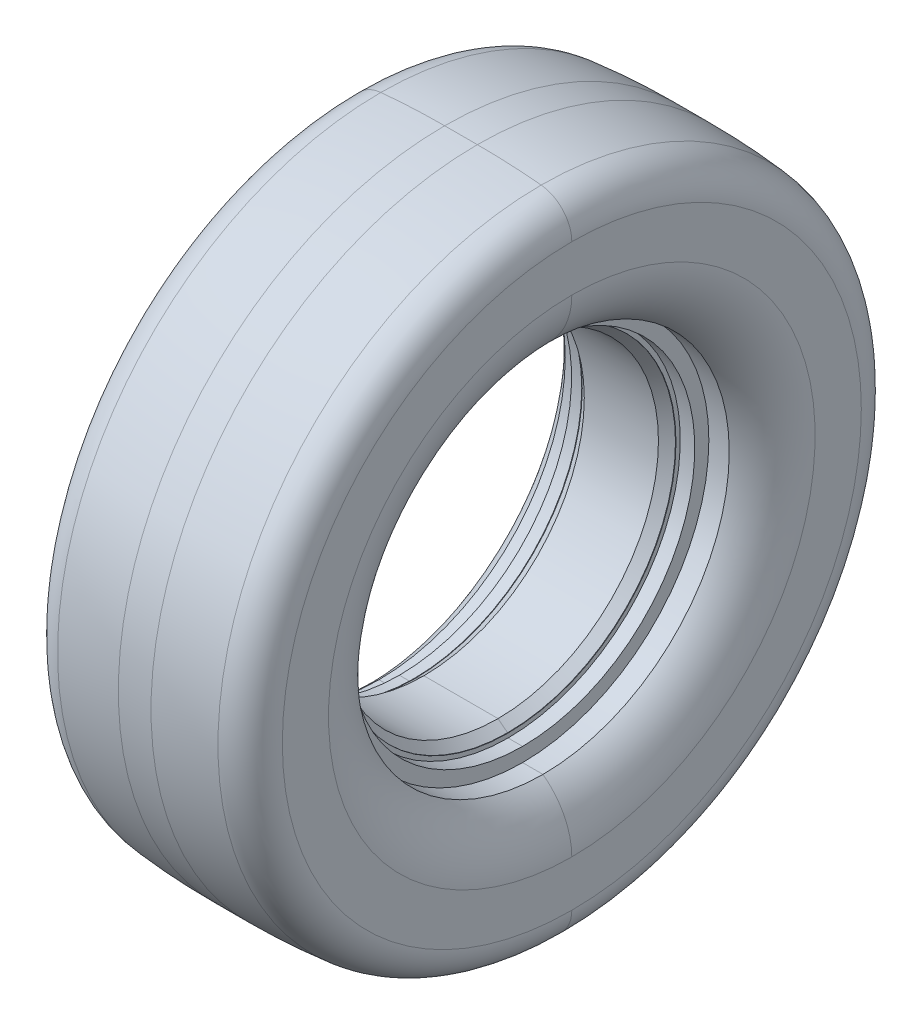
ISO-10303-21;
HEADER;
FILE_DESCRIPTION(('STEP AP214'),'2;1');
FILE_NAME('part.step','',(''),(''),'','','');
FILE_SCHEMA(('AUTOMOTIVE_DESIGN { 1 0 10303 214 1 1 1 1 }'));
ENDSEC;
DATA;
#1=APPLICATION_CONTEXT('core data for automotive mechanical design processes');
#2=APPLICATION_PROTOCOL_DEFINITION('international standard','automotive_design',2000,#1);
#3=PRODUCT_CONTEXT('',#1,'mechanical');
#4=PRODUCT('Part','Part','',(#3));
#5=PRODUCT_RELATED_PRODUCT_CATEGORY('part','',(#4));
#6=PRODUCT_DEFINITION_FORMATION('','',#4);
#7=PRODUCT_DEFINITION_CONTEXT('part definition',#1,'design');
#8=PRODUCT_DEFINITION('design','',#6,#7);
#9=PRODUCT_DEFINITION_SHAPE('','',#8);
#10=(LENGTH_UNIT() NAMED_UNIT(*) SI_UNIT(.MILLI.,.METRE.));
#11=(NAMED_UNIT(*) PLANE_ANGLE_UNIT() SI_UNIT($,.RADIAN.));
#12=(NAMED_UNIT(*) SI_UNIT($,.STERADIAN.) SOLID_ANGLE_UNIT());
#13=UNCERTAINTY_MEASURE_WITH_UNIT(LENGTH_MEASURE(1.E-05),#10,'distance_accuracy_value','');
#14=(GEOMETRIC_REPRESENTATION_CONTEXT(3) GLOBAL_UNCERTAINTY_ASSIGNED_CONTEXT((#13)) GLOBAL_UNIT_ASSIGNED_CONTEXT((#10,
#11,#12)) REPRESENTATION_CONTEXT('',''));
#15=CARTESIAN_POINT('',(0.,0.,0.));
#16=DIRECTION('',(0.,0.,1.));
#17=DIRECTION('',(1.,0.,0.));
#18=AXIS2_PLACEMENT_3D('',#15,#16,#17);
#19=CARTESIAN_POINT('',(-55.0616473772124,-7.13441573293494,32.9182579355347));
#20=DIRECTION('',(-1.,0.,0.));
#21=DIRECTION('',(0.,-1.,0.));
#22=AXIS2_PLACEMENT_3D('',#19,#20,#21);
#23=CYLINDRICAL_SURFACE('',#22,24.1681);
#24=DIRECTION('',(-1.,0.,0.));
#25=VECTOR('',#24,1.);
#26=CARTESIAN_POINT('',(-55.0616473772124,17.0336842670651,32.9182579355347));
#27=LINE('',#26,#25);
#28=CARTESIAN_POINT('',(-56.5729473772124,17.0336842670651,32.9182579355347));
#29=VERTEX_POINT('',#28);
#30=CARTESIAN_POINT('',(-67.7489473772124,17.0336842670651,32.9182579355347));
#31=VERTEX_POINT('',#30);
#32=EDGE_CURVE('E234',#29,#31,#27,.T.);
#33=ORIENTED_EDGE('',*,*,#32,.F.);
#34=CARTESIAN_POINT('',(-56.5729473772124,-7.13441573293494,32.9182579355347));
#35=DIRECTION('',(-1.,0.,0.));
#36=DIRECTION('',(0.,-1.,0.));
#37=AXIS2_PLACEMENT_3D('',#34,#35,#36);
#38=CIRCLE('',#37,24.1681);
#39=CARTESIAN_POINT('',(-56.5729473772124,-31.302515732935,32.9182579355347));
#40=VERTEX_POINT('',#39);
#41=EDGE_CURVE('E249',#40,#29,#38,.T.);
#42=ORIENTED_EDGE('',*,*,#41,.F.);
#43=DIRECTION('',(-1.,0.,0.));
#44=VECTOR('',#43,1.);
#45=CARTESIAN_POINT('',(-55.0616473772124,-31.302515732935,32.9182579355347));
#46=LINE('',#45,#44);
#47=CARTESIAN_POINT('',(-67.7489473772124,-31.3025157329349,32.9182579355347));
#48=VERTEX_POINT('',#47);
#49=EDGE_CURVE('E233',#40,#48,#46,.T.);
#50=ORIENTED_EDGE('',*,*,#49,.T.);
#51=CARTESIAN_POINT('',(-67.7489473772124,-7.13441573293493,32.9182579355347));
#52=DIRECTION('',(-1.,0.,0.));
#53=DIRECTION('',(0.,-1.,0.));
#54=AXIS2_PLACEMENT_3D('',#51,#52,#53);
#55=CIRCLE('',#54,24.1681);
#56=EDGE_CURVE('E11',#48,#31,#55,.T.);
#57=ORIENTED_EDGE('',*,*,#56,.T.);
#58=EDGE_LOOP('',(#33,#42,#50,#57));
#59=FACE_BOUND('',#58,.T.);
#60=ADVANCED_FACE('F17',(#59),#23,.F.);
#61=CARTESIAN_POINT('',(-67.7489473772124,-7.13441573293493,32.9182579355347));
#62=DIRECTION('',(-1.,0.,0.));
#63=DIRECTION('',(0.,-1.,0.));
#64=AXIS2_PLACEMENT_3D('',#61,#62,#63);
#65=CONICAL_SURFACE('',#64,24.1681,0.667140654258367);
#66=DIRECTION('',(-0.785594072893806,0.618742234403084,0.));
#67=VECTOR('',#66,1.);
#68=CARTESIAN_POINT('',(-67.7489473772124,17.0336842670651,32.9182579355347));
#69=LINE('',#68,#67);
#70=CARTESIAN_POINT('',(-69.1840473772124,18.163984267065,32.9182579355347));
#71=VERTEX_POINT('',#70);
#72=EDGE_CURVE('E223',#31,#71,#69,.T.);
#73=ORIENTED_EDGE('',*,*,#72,.F.);
#74=ORIENTED_EDGE('',*,*,#56,.F.);
#75=DIRECTION('',(-0.785594072893807,-0.618742234403083,0.));
#76=VECTOR('',#75,1.);
#77=CARTESIAN_POINT('',(-67.7489473772124,-31.3025157329349,32.9182579355347));
#78=LINE('',#77,#76);
#79=CARTESIAN_POINT('',(-69.1840473772124,-32.4328157329349,32.9182579355347));
#80=VERTEX_POINT('',#79);
#81=EDGE_CURVE('E299',#48,#80,#78,.T.);
#82=ORIENTED_EDGE('',*,*,#81,.T.);
#83=CARTESIAN_POINT('',(-69.1840473772124,-7.13441573293493,32.9182579355347));
#84=DIRECTION('',(-1.,0.,0.));
#85=DIRECTION('',(0.,-1.,0.));
#86=AXIS2_PLACEMENT_3D('',#83,#84,#85);
#87=CIRCLE('',#86,25.2984);
#88=EDGE_CURVE('E27',#80,#71,#87,.T.);
#89=ORIENTED_EDGE('',*,*,#88,.T.);
#90=EDGE_LOOP('',(#73,#74,#82,#89));
#91=FACE_BOUND('',#90,.T.);
#92=ADVANCED_FACE('F640',(#91),#65,.F.);
#93=CARTESIAN_POINT('',(-55.0616473772124,-7.13441573293494,32.9182579355347));
#94=DIRECTION('',(-1.,0.,0.));
#95=DIRECTION('',(0.,-1.,0.));
#96=AXIS2_PLACEMENT_3D('',#93,#94,#95);
#97=CYLINDRICAL_SURFACE('',#96,25.2984);
#98=DIRECTION('',(-1.,0.,0.));
#99=VECTOR('',#98,1.);
#100=CARTESIAN_POINT('',(-55.0616473772124,18.163984267065,32.9182579355347));
#101=LINE('',#100,#99);
#102=CARTESIAN_POINT('',(-69.2602473772124,18.163984267065,32.9182579355347));
#103=VERTEX_POINT('',#102);
#104=EDGE_CURVE('E294',#71,#103,#101,.T.);
#105=ORIENTED_EDGE('',*,*,#104,.F.);
#106=ORIENTED_EDGE('',*,*,#88,.F.);
#107=DIRECTION('',(-1.,0.,0.));
#108=VECTOR('',#107,1.);
#109=CARTESIAN_POINT('',(-55.0616473772124,-32.432815732935,32.9182579355347));
#110=LINE('',#109,#108);
#111=CARTESIAN_POINT('',(-69.2602473772124,-32.4328157329349,32.9182579355347));
#112=VERTEX_POINT('',#111);
#113=EDGE_CURVE('E318',#80,#112,#110,.T.);
#114=ORIENTED_EDGE('',*,*,#113,.T.);
#115=CARTESIAN_POINT('',(-69.2602473772124,-7.13441573293493,32.9182579355347));
#116=DIRECTION('',(-1.,0.,0.));
#117=DIRECTION('',(0.,-1.,0.));
#118=AXIS2_PLACEMENT_3D('',#115,#116,#117);
#119=CIRCLE('',#118,25.2984);
#120=EDGE_CURVE('E253',#112,#103,#119,.T.);
#121=ORIENTED_EDGE('',*,*,#120,.T.);
#122=EDGE_LOOP('',(#105,#106,#114,#121));
#123=FACE_BOUND('',#122,.T.);
#124=ADVANCED_FACE('F538',(#123),#97,.F.);
#125=CARTESIAN_POINT('',(-55.0616473772124,-7.13441573293494,32.9182579355347));
#126=DIRECTION('',(-1.,0.,0.));
#127=DIRECTION('',(0.,-1.,0.));
#128=AXIS2_PLACEMENT_3D('',#125,#126,#127);
#129=CYLINDRICAL_SURFACE('',#128,25.2984);
#130=DIRECTION('',(-1.,0.,0.));
#131=VECTOR('',#130,1.);
#132=CARTESIAN_POINT('',(-55.0616473772124,18.163984267065,32.9182579355347));
#133=LINE('',#132,#131);
#134=CARTESIAN_POINT('',(-55.0616473772124,18.163984267065,32.9182579355347));
#135=VERTEX_POINT('',#134);
#136=CARTESIAN_POINT('',(-55.1378473772123,18.163984267065,32.9182579355347));
#137=VERTEX_POINT('',#136);
#138=EDGE_CURVE('E304',#135,#137,#133,.T.);
#139=ORIENTED_EDGE('',*,*,#138,.F.);
#140=CARTESIAN_POINT('',(-55.0616473772124,-7.13441573293494,32.9182579355347));
#141=DIRECTION('',(-1.,0.,0.));
#142=DIRECTION('',(0.,-1.,0.));
#143=AXIS2_PLACEMENT_3D('',#140,#141,#142);
#144=CIRCLE('',#143,25.2984);
#145=CARTESIAN_POINT('',(-55.0616473772124,-32.432815732935,32.9182579355347));
#146=VERTEX_POINT('',#145);
#147=EDGE_CURVE('E354',#146,#135,#144,.T.);
#148=ORIENTED_EDGE('',*,*,#147,.F.);
#149=DIRECTION('',(-1.,0.,0.));
#150=VECTOR('',#149,1.);
#151=CARTESIAN_POINT('',(-55.0616473772124,-32.432815732935,32.9182579355347));
#152=LINE('',#151,#150);
#153=CARTESIAN_POINT('',(-55.1378473772124,-32.432815732935,32.9182579355347));
#154=VERTEX_POINT('',#153);
#155=EDGE_CURVE('E348',#146,#154,#152,.T.);
#156=ORIENTED_EDGE('',*,*,#155,.T.);
#157=CARTESIAN_POINT('',(-55.1378473772124,-7.13441573293494,32.9182579355347));
#158=DIRECTION('',(-1.,0.,0.));
#159=DIRECTION('',(0.,-1.,0.));
#160=AXIS2_PLACEMENT_3D('',#157,#158,#159);
#161=CIRCLE('',#160,25.2984);
#162=EDGE_CURVE('E246',#154,#137,#161,.T.);
#163=ORIENTED_EDGE('',*,*,#162,.T.);
#164=EDGE_LOOP('',(#139,#148,#156,#163));
#165=FACE_BOUND('',#164,.T.);
#166=ADVANCED_FACE('F452',(#165),#129,.F.);
#167=CARTESIAN_POINT('',(-56.5729473772124,-7.13441573293494,32.9182579355347));
#168=DIRECTION('',(1.,0.,0.));
#169=DIRECTION('',(0.,1.,0.));
#170=AXIS2_PLACEMENT_3D('',#167,#168,#169);
#171=CONICAL_SURFACE('',#170,24.1681,0.667140654258367);
#172=DIRECTION('',(0.785594072893806,-0.618742234403084,0.));
#173=VECTOR('',#172,1.);
#174=CARTESIAN_POINT('',(-56.5729473772124,-31.302515732935,32.9182579355347));
#175=LINE('',#174,#173);
#176=EDGE_CURVE('E347',#40,#154,#175,.T.);
#177=ORIENTED_EDGE('',*,*,#176,.F.);
#178=ORIENTED_EDGE('',*,*,#41,.T.);
#179=DIRECTION('',(0.785594072893807,0.618742234403084,0.));
#180=VECTOR('',#179,1.);
#181=CARTESIAN_POINT('',(-56.5729473772124,17.0336842670651,32.9182579355347));
#182=LINE('',#181,#180);
#183=EDGE_CURVE('E343',#29,#137,#182,.T.);
#184=ORIENTED_EDGE('',*,*,#183,.T.);
#185=ORIENTED_EDGE('',*,*,#162,.F.);
#186=EDGE_LOOP('',(#177,#178,#184,#185));
#187=FACE_BOUND('',#186,.T.);
#188=ADVANCED_FACE('F435',(#187),#171,.F.);
#189=CARTESIAN_POINT('',(-69.2602473772124,0.,32.9182579355347));
#190=DIRECTION('',(-1.,0.,0.));
#191=DIRECTION('',(0.,0.,1.));
#192=AXIS2_PLACEMENT_3D('',#189,#190,#191);
#193=PLANE('',#192);
#194=ORIENTED_EDGE('',*,*,#120,.F.);
#195=CARTESIAN_POINT('',(-69.2602473772124,-7.13441573293493,32.9182579355347));
#196=DIRECTION('',(-1.,0.,0.));
#197=DIRECTION('',(0.,-1.,0.));
#198=AXIS2_PLACEMENT_3D('',#195,#196,#197);
#199=CIRCLE('',#198,25.2984);
#200=EDGE_CURVE('E298',#103,#112,#199,.T.);
#201=ORIENTED_EDGE('',*,*,#200,.F.);
#202=EDGE_LOOP('',(#194,#201));
#203=FACE_BOUND('',#202,.T.);
#204=CARTESIAN_POINT('',(-69.2602473772124,-7.13441573293493,32.9182579355347));
#205=DIRECTION('',(-1.,0.,0.));
#206=DIRECTION('',(0.,-1.,0.));
#207=AXIS2_PLACEMENT_3D('',#204,#205,#206);
#208=CIRCLE('',#207,25.9461);
#209=CARTESIAN_POINT('',(-69.2602473772124,-33.0805157329349,32.9182579355347));
#210=VERTEX_POINT('',#209);
#211=CARTESIAN_POINT('',(-69.2602473772124,18.8116842670651,32.9182579355347));
#212=VERTEX_POINT('',#211);
#213=EDGE_CURVE('E199',#210,#212,#208,.T.);
#214=ORIENTED_EDGE('',*,*,#213,.T.);
#215=CARTESIAN_POINT('',(-69.2602473772124,-7.13441573293493,32.9182579355347));
#216=DIRECTION('',(-1.,0.,0.));
#217=DIRECTION('',(0.,-1.,0.));
#218=AXIS2_PLACEMENT_3D('',#215,#216,#217);
#219=CIRCLE('',#218,25.9461);
#220=EDGE_CURVE('E219',#212,#210,#219,.T.);
#221=ORIENTED_EDGE('',*,*,#220,.T.);
#222=EDGE_LOOP('',(#214,#221));
#223=FACE_BOUND('',#222,.T.);
#224=ADVANCED_FACE('F585',(#203,#223),#193,.T.);
#225=CARTESIAN_POINT('',(-55.0616473772124,-7.13441573293494,32.9182579355347));
#226=DIRECTION('',(-1.,0.,0.));
#227=DIRECTION('',(0.,-1.,0.));
#228=AXIS2_PLACEMENT_3D('',#225,#226,#227);
#229=CYLINDRICAL_SURFACE('',#228,25.9461);
#230=DIRECTION('',(-1.,0.,0.));
#231=VECTOR('',#230,1.);
#232=CARTESIAN_POINT('',(-55.0616473772124,18.8116842670651,32.9182579355347));
#233=LINE('',#232,#231);
#234=CARTESIAN_POINT('',(-71.4446473772124,18.8116842670651,32.9182579355347));
#235=VERTEX_POINT('',#234);
#236=EDGE_CURVE('E211',#212,#235,#233,.T.);
#237=ORIENTED_EDGE('',*,*,#236,.F.);
#238=ORIENTED_EDGE('',*,*,#213,.F.);
#239=DIRECTION('',(-1.,0.,0.));
#240=VECTOR('',#239,1.);
#241=CARTESIAN_POINT('',(-55.0616473772124,-33.0805157329349,32.9182579355347));
#242=LINE('',#241,#240);
#243=CARTESIAN_POINT('',(-71.4446473772124,-33.0805157329349,32.9182579355347));
#244=VERTEX_POINT('',#243);
#245=EDGE_CURVE('E202',#210,#244,#242,.T.);
#246=ORIENTED_EDGE('',*,*,#245,.T.);
#247=CARTESIAN_POINT('',(-71.4446473772124,-7.13441573293493,32.9182579355347));
#248=DIRECTION('',(-1.,0.,0.));
#249=DIRECTION('',(0.,-1.,0.));
#250=AXIS2_PLACEMENT_3D('',#247,#248,#249);
#251=CIRCLE('',#250,25.9461);
#252=EDGE_CURVE('E189',#244,#235,#251,.T.);
#253=ORIENTED_EDGE('',*,*,#252,.T.);
#254=EDGE_LOOP('',(#237,#238,#246,#253));
#255=FACE_BOUND('',#254,.T.);
#256=ADVANCED_FACE('F203',(#255),#229,.F.);
#257=CARTESIAN_POINT('',(-71.4446473772124,0.,32.9182579355347));
#258=DIRECTION('',(-1.,0.,0.));
#259=DIRECTION('',(0.,0.,1.));
#260=AXIS2_PLACEMENT_3D('',#257,#258,#259);
#261=PLANE('',#260);
#262=ORIENTED_EDGE('',*,*,#252,.F.);
#263=CARTESIAN_POINT('',(-71.4446473772124,-7.13441573293493,32.9182579355347));
#264=DIRECTION('',(-1.,0.,0.));
#265=DIRECTION('',(0.,-1.,0.));
#266=AXIS2_PLACEMENT_3D('',#263,#264,#265);
#267=CIRCLE('',#266,25.9461);
#268=EDGE_CURVE('E194',#235,#244,#267,.T.);
#269=ORIENTED_EDGE('',*,*,#268,.F.);
#270=EDGE_LOOP('',(#262,#269));
#271=FACE_BOUND('',#270,.T.);
#272=CARTESIAN_POINT('',(-71.4446473772124,-7.13441573293493,32.9182579355347));
#273=DIRECTION('',(-1.,0.,0.));
#274=DIRECTION('',(0.,-1.,0.));
#275=AXIS2_PLACEMENT_3D('',#272,#273,#274);
#276=CIRCLE('',#275,28.067);
#277=CARTESIAN_POINT('',(-71.4446473772124,-35.2014157329349,32.9182579355347));
#278=VERTEX_POINT('',#277);
#279=CARTESIAN_POINT('',(-71.4446473772124,20.932584267065,32.9182579355347));
#280=VERTEX_POINT('',#279);
#281=EDGE_CURVE('E178',#278,#280,#276,.T.);
#282=ORIENTED_EDGE('',*,*,#281,.T.);
#283=CARTESIAN_POINT('',(-71.4446473772124,-7.13441573293493,32.9182579355347));
#284=DIRECTION('',(-1.,0.,0.));
#285=DIRECTION('',(0.,-1.,0.));
#286=AXIS2_PLACEMENT_3D('',#283,#284,#285);
#287=CIRCLE('',#286,28.067);
#288=EDGE_CURVE('E208',#280,#278,#287,.T.);
#289=ORIENTED_EDGE('',*,*,#288,.T.);
#290=EDGE_LOOP('',(#282,#289));
#291=FACE_BOUND('',#290,.T.);
#292=ADVANCED_FACE('F191',(#271,#291),#261,.T.);
#293=CARTESIAN_POINT('',(-55.0616473772124,-7.13441573293494,32.9182579355347));
#294=DIRECTION('',(-1.,0.,0.));
#295=DIRECTION('',(0.,-1.,0.));
#296=AXIS2_PLACEMENT_3D('',#293,#294,#295);
#297=CYLINDRICAL_SURFACE('',#296,28.067);
#298=DIRECTION('',(-1.,0.,0.));
#299=VECTOR('',#298,1.);
#300=CARTESIAN_POINT('',(-55.0616473772124,20.932584267065,32.9182579355347));
#301=LINE('',#300,#299);
#302=CARTESIAN_POINT('',(-74.5171951928295,20.932584267065,32.9182579355347));
#303=VERTEX_POINT('',#302);
#304=EDGE_CURVE('E303',#280,#303,#301,.T.);
#305=ORIENTED_EDGE('',*,*,#304,.F.);
#306=ORIENTED_EDGE('',*,*,#281,.F.);
#307=DIRECTION('',(-1.,0.,0.));
#308=VECTOR('',#307,1.);
#309=CARTESIAN_POINT('',(-55.0616473772124,-35.2014157329349,32.9182579355347));
#310=LINE('',#309,#308);
#311=CARTESIAN_POINT('',(-74.5171951928295,-35.2014157329349,32.9182579355347));
#312=VERTEX_POINT('',#311);
#313=EDGE_CURVE('E225',#278,#312,#310,.T.);
#314=ORIENTED_EDGE('',*,*,#313,.T.);
#315=CARTESIAN_POINT('',(-74.5171951928295,-7.13441573293493,32.9182579355347));
#316=DIRECTION('',(-1.,0.,0.));
#317=DIRECTION('',(0.,-1.,0.));
#318=AXIS2_PLACEMENT_3D('',#315,#316,#317);
#319=CIRCLE('',#318,28.067);
#320=EDGE_CURVE('E167',#312,#303,#319,.T.);
#321=ORIENTED_EDGE('',*,*,#320,.T.);
#322=EDGE_LOOP('',(#305,#306,#314,#321));
#323=FACE_BOUND('',#322,.T.);
#324=ADVANCED_FACE('F19',(#323),#297,.F.);
#325=CARTESIAN_POINT('',(-68.181080824701,-7.13441573293493,32.9182579355347));
#326=DIRECTION('',(-1.,0.,0.));
#327=DIRECTION('',(0.,-1.,0.));
#328=AXIS2_PLACEMENT_3D('',#325,#326,#327);
#329=TOROIDAL_SURFACE('',#328,36.6649,10.6803665525114);
#330=CARTESIAN_POINT('',(-68.1810808247009,29.530484267065,32.9182579355347));
#331=DIRECTION('',(0.,0.,1.));
#332=DIRECTION('',(0.,-1.,0.));
#333=AXIS2_PLACEMENT_3D('',#330,#331,#332);
#334=CIRCLE('',#333,10.6803665525114);
#335=CARTESIAN_POINT('',(-78.8614473772124,29.530484267065,32.9182579355347));
#336=VERTEX_POINT('',#335);
#337=EDGE_CURVE('E257',#336,#303,#334,.T.);
#338=ORIENTED_EDGE('',*,*,#337,.F.);
#339=CARTESIAN_POINT('',(-78.8614473772124,-7.13441573293492,32.9182579355347));
#340=DIRECTION('',(-1.,0.,0.));
#341=DIRECTION('',(0.,-1.,0.));
#342=AXIS2_PLACEMENT_3D('',#339,#340,#341);
#343=CIRCLE('',#342,36.6649);
#344=CARTESIAN_POINT('',(-78.8614473772124,-43.7993157329349,32.9182579355347));
#345=VERTEX_POINT('',#344);
#346=EDGE_CURVE('E369',#336,#345,#343,.T.);
#347=ORIENTED_EDGE('',*,*,#346,.T.);
#348=CARTESIAN_POINT('',(-68.181080824701,-43.799315732935,32.9182579355347));
#349=DIRECTION('',(0.,0.,-1.));
#350=DIRECTION('',(-1.,0.,0.));
#351=AXIS2_PLACEMENT_3D('',#348,#349,#350);
#352=CIRCLE('',#351,10.6803665525114);
#353=EDGE_CURVE('E328',#345,#312,#352,.T.);
#354=ORIENTED_EDGE('',*,*,#353,.T.);
#355=CARTESIAN_POINT('',(-74.5171951928295,-7.13441573293493,32.9182579355347));
#356=DIRECTION('',(-1.,0.,0.));
#357=DIRECTION('',(0.,-1.,0.));
#358=AXIS2_PLACEMENT_3D('',#355,#356,#357);
#359=CIRCLE('',#358,28.067);
#360=EDGE_CURVE('E228',#303,#312,#359,.T.);
#361=ORIENTED_EDGE('',*,*,#360,.F.);
#362=EDGE_LOOP('',(#338,#347,#354,#361));
#363=FACE_BOUND('',#362,.T.);
#364=ADVANCED_FACE('F531',(#363),#329,.T.);
#365=CARTESIAN_POINT('',(-78.8614473772124,0.,32.9182579355347));
#366=DIRECTION('',(-1.,0.,0.));
#367=DIRECTION('',(0.,0.,1.));
#368=AXIS2_PLACEMENT_3D('',#365,#366,#367);
#369=PLANE('',#368);
#370=CARTESIAN_POINT('',(-78.8614473772124,-7.13441573293492,32.9182579355347));
#371=DIRECTION('',(-1.,0.,0.));
#372=DIRECTION('',(0.,-1.,0.));
#373=AXIS2_PLACEMENT_3D('',#370,#371,#372);
#374=CIRCLE('',#373,36.6649);
#375=EDGE_CURVE('E227',#345,#336,#374,.T.);
#376=ORIENTED_EDGE('',*,*,#375,.F.);
#377=ORIENTED_EDGE('',*,*,#346,.F.);
#378=EDGE_LOOP('',(#376,#377));
#379=FACE_BOUND('',#378,.T.);
#380=CARTESIAN_POINT('',(-78.8614473772124,-7.13441573293492,32.9182579355347));
#381=DIRECTION('',(-1.,0.,0.));
#382=DIRECTION('',(0.,-1.,0.));
#383=AXIS2_PLACEMENT_3D('',#380,#381,#382);
#384=CIRCLE('',#383,43.6245);
#385=CARTESIAN_POINT('',(-78.8614473772124,-50.7589157329349,32.9182579355347));
#386=VERTEX_POINT('',#385);
#387=CARTESIAN_POINT('',(-78.8614473772124,36.4900842670651,32.9182579355347));
#388=VERTEX_POINT('',#387);
#389=EDGE_CURVE('E239',#386,#388,#384,.T.);
#390=ORIENTED_EDGE('',*,*,#389,.T.);
#391=CARTESIAN_POINT('',(-78.8614473772124,-7.13441573293492,32.9182579355347));
#392=DIRECTION('',(-1.,0.,0.));
#393=DIRECTION('',(0.,-1.,0.));
#394=AXIS2_PLACEMENT_3D('',#391,#392,#393);
#395=CIRCLE('',#394,43.6245);
#396=EDGE_CURVE('E322',#388,#386,#395,.T.);
#397=ORIENTED_EDGE('',*,*,#396,.T.);
#398=EDGE_LOOP('',(#390,#397));
#399=FACE_BOUND('',#398,.T.);
#400=ADVANCED_FACE('F595',(#379,#399),#369,.T.);
#401=CARTESIAN_POINT('',(-73.7520346419656,-7.13441573293492,32.9182579355347));
#402=DIRECTION('',(-1.,0.,0.));
#403=DIRECTION('',(0.,-1.,0.));
#404=AXIS2_PLACEMENT_3D('',#401,#402,#403);
#405=TOROIDAL_SURFACE('',#404,43.6245,5.10941273524675);
#406=CARTESIAN_POINT('',(-73.7520346419656,36.4900842670651,32.9182579355347));
#407=DIRECTION('',(0.,0.,1.));
#408=DIRECTION('',(0.,-1.,0.));
#409=AXIS2_PLACEMENT_3D('',#406,#407,#408);
#410=CIRCLE('',#409,5.10941273524675);
#411=CARTESIAN_POINT('',(-74.2440789435599,41.5757495042164,32.9182579355347));
#412=VERTEX_POINT('',#411);
#413=EDGE_CURVE('E235',#412,#388,#410,.T.);
#414=ORIENTED_EDGE('',*,*,#413,.F.);
#415=CARTESIAN_POINT('',(-74.2440789435599,-7.13441573293493,32.9182579355347));
#416=DIRECTION('',(-1.,0.,0.));
#417=DIRECTION('',(0.,-1.,0.));
#418=AXIS2_PLACEMENT_3D('',#415,#416,#417);
#419=CIRCLE('',#418,48.7101652371514);
#420=CARTESIAN_POINT('',(-74.2440789435599,-55.8445809700863,32.9182579355347));
#421=VERTEX_POINT('',#420);
#422=EDGE_CURVE('E319',#412,#421,#419,.T.);
#423=ORIENTED_EDGE('',*,*,#422,.T.);
#424=CARTESIAN_POINT('',(-73.7520346419656,-50.7589157329349,32.9182579355347));
#425=DIRECTION('',(0.,0.,-1.));
#426=DIRECTION('',(-1.,0.,0.));
#427=AXIS2_PLACEMENT_3D('',#424,#425,#426);
#428=CIRCLE('',#427,5.10941273524676);
#429=EDGE_CURVE('E334',#421,#386,#428,.T.);
#430=ORIENTED_EDGE('',*,*,#429,.T.);
#431=ORIENTED_EDGE('',*,*,#396,.F.);
#432=EDGE_LOOP('',(#414,#423,#430,#431));
#433=FACE_BOUND('',#432,.T.);
#434=ADVANCED_FACE('F590',(#433),#405,.T.);
#435=CARTESIAN_POINT('',(-64.6252100949549,-7.13441573293493,32.9182579355347));
#436=DIRECTION('',(-1.,0.,0.));
#437=DIRECTION('',(0.,1.,0.));
#438=AXIS2_PLACEMENT_3D('',#435,#436,#437);
#439=DEGENERATE_TOROIDAL_SURFACE('',#438,50.708417125386,99.8828171253859,.F.);
#440=CARTESIAN_POINT('',(-64.6252100949549,-57.8428328583209,32.9182579355347));
#441=DIRECTION('',(0.,0.,1.));
#442=DIRECTION('',(0.,-1.,0.));
#443=AXIS2_PLACEMENT_3D('',#440,#441,#442);
#444=CIRCLE('',#443,99.8828171253859);
#445=CARTESIAN_POINT('',(-64.6252100949549,42.039984267065,32.9182579355347));
#446=VERTEX_POINT('',#445);
#447=EDGE_CURVE('E333',#446,#412,#444,.T.);
#448=ORIENTED_EDGE('',*,*,#447,.F.);
#449=CARTESIAN_POINT('',(-64.6252100949549,-7.13441573293493,32.9182579355347));
#450=DIRECTION('',(-1.,0.,0.));
#451=DIRECTION('',(0.,-1.,0.));
#452=AXIS2_PLACEMENT_3D('',#449,#450,#451);
#453=CIRCLE('',#452,49.1744);
#454=CARTESIAN_POINT('',(-64.625210094955,-56.3088157329349,32.9182579355347));
#455=VERTEX_POINT('',#454);
#456=EDGE_CURVE('E21',#446,#455,#453,.T.);
#457=ORIENTED_EDGE('',*,*,#456,.T.);
#458=CARTESIAN_POINT('',(-64.6252100949549,43.574001392451,32.9182579355347));
#459=DIRECTION('',(0.,0.,-1.));
#460=DIRECTION('',(-1.,0.,0.));
#461=AXIS2_PLACEMENT_3D('',#458,#459,#460);
#462=CIRCLE('',#461,99.8828171253859);
#463=EDGE_CURVE('E277',#455,#421,#462,.T.);
#464=ORIENTED_EDGE('',*,*,#463,.T.);
#465=ORIENTED_EDGE('',*,*,#422,.F.);
#466=EDGE_LOOP('',(#448,#457,#464,#465));
#467=FACE_BOUND('',#466,.T.);
#468=ADVANCED_FACE('F594',(#467),#439,.F.);
#469=CARTESIAN_POINT('',(-55.0616473772124,-7.13441573293494,32.9182579355347));
#470=DIRECTION('',(-1.,0.,0.));
#471=DIRECTION('',(0.,-1.,0.));
#472=AXIS2_PLACEMENT_3D('',#469,#470,#471);
#473=CYLINDRICAL_SURFACE('',#472,49.1744);
#474=DIRECTION('',(-1.,0.,0.));
#475=VECTOR('',#474,1.);
#476=CARTESIAN_POINT('',(-55.0616473772123,42.039984267065,32.9182579355347));
#477=LINE('',#476,#475);
#478=CARTESIAN_POINT('',(-59.6966846594698,42.039984267065,32.9182579355347));
#479=VERTEX_POINT('',#478);
#480=EDGE_CURVE('E276',#479,#446,#477,.T.);
#481=ORIENTED_EDGE('',*,*,#480,.F.);
#482=CARTESIAN_POINT('',(-59.6966846594698,-7.13441573293493,32.9182579355347));
#483=DIRECTION('',(-1.,0.,0.));
#484=DIRECTION('',(0.,-1.,0.));
#485=AXIS2_PLACEMENT_3D('',#482,#483,#484);
#486=CIRCLE('',#485,49.1744);
#487=CARTESIAN_POINT('',(-59.6966846594699,-56.3088157329349,32.9182579355347));
#488=VERTEX_POINT('',#487);
#489=EDGE_CURVE('E293',#479,#488,#486,.T.);
#490=ORIENTED_EDGE('',*,*,#489,.T.);
#491=DIRECTION('',(-1.,0.,0.));
#492=VECTOR('',#491,1.);
#493=CARTESIAN_POINT('',(-55.0616473772124,-56.3088157329349,32.9182579355347));
#494=LINE('',#493,#492);
#495=EDGE_CURVE('E263',#488,#455,#494,.T.);
#496=ORIENTED_EDGE('',*,*,#495,.T.);
#497=ORIENTED_EDGE('',*,*,#456,.F.);
#498=EDGE_LOOP('',(#481,#490,#496,#497));
#499=FACE_BOUND('',#498,.T.);
#500=ADVANCED_FACE('F623',(#499),#473,.T.);
#501=CARTESIAN_POINT('',(-59.6966846594698,-7.13441573293493,32.9182579355347));
#502=DIRECTION('',(-1.,0.,0.));
#503=DIRECTION('',(0.,1.,0.));
#504=AXIS2_PLACEMENT_3D('',#501,#502,#503);
#505=DEGENERATE_TOROIDAL_SURFACE('',#504,50.708417125386,99.8828171253859,.F.);
#506=CARTESIAN_POINT('',(-59.6966846594698,-57.8428328583209,32.9182579355347));
#507=DIRECTION('',(0.,0.,1.));
#508=DIRECTION('',(0.,-1.,0.));
#509=AXIS2_PLACEMENT_3D('',#506,#507,#508);
#510=CIRCLE('',#509,99.8828171253859);
#511=CARTESIAN_POINT('',(-50.0778158108648,41.5757495042164,32.9182579355347));
#512=VERTEX_POINT('',#511);
#513=EDGE_CURVE('E262',#512,#479,#510,.T.);
#514=ORIENTED_EDGE('',*,*,#513,.F.);
#515=CARTESIAN_POINT('',(-50.0778158108649,-7.13441573293494,32.9182579355347));
#516=DIRECTION('',(-1.,0.,0.));
#517=DIRECTION('',(0.,-1.,0.));
#518=AXIS2_PLACEMENT_3D('',#515,#516,#517);
#519=CIRCLE('',#518,48.7101652371514);
#520=CARTESIAN_POINT('',(-50.0778158108649,-55.8445809700863,32.9182579355347));
#521=VERTEX_POINT('',#520);
#522=EDGE_CURVE('E289',#512,#521,#519,.T.);
#523=ORIENTED_EDGE('',*,*,#522,.T.);
#524=CARTESIAN_POINT('',(-59.6966846594697,43.574001392451,32.9182579355347));
#525=DIRECTION('',(0.,0.,-1.));
#526=DIRECTION('',(-1.,0.,0.));
#527=AXIS2_PLACEMENT_3D('',#524,#525,#526);
#528=CIRCLE('',#527,99.8828171253859);
#529=EDGE_CURVE('E264',#521,#488,#528,.T.);
#530=ORIENTED_EDGE('',*,*,#529,.T.);
#531=ORIENTED_EDGE('',*,*,#489,.F.);
#532=EDGE_LOOP('',(#514,#523,#530,#531));
#533=FACE_BOUND('',#532,.T.);
#534=ADVANCED_FACE('F566',(#533),#505,.F.);
#535=CARTESIAN_POINT('',(-50.5698601124591,-7.13441573293493,32.9182579355347));
#536=DIRECTION('',(-1.,0.,0.));
#537=DIRECTION('',(0.,-1.,0.));
#538=AXIS2_PLACEMENT_3D('',#535,#536,#537);
#539=TOROIDAL_SURFACE('',#538,43.6245,5.10941273524675);
#540=CARTESIAN_POINT('',(-50.5698601124591,36.4900842670651,32.9182579355347));
#541=DIRECTION('',(0.,0.,1.));
#542=DIRECTION('',(0.,-1.,0.));
#543=AXIS2_PLACEMENT_3D('',#540,#541,#542);
#544=CIRCLE('',#543,5.10941273524675);
#545=CARTESIAN_POINT('',(-45.4604473772124,36.4900842670651,32.9182579355347));
#546=VERTEX_POINT('',#545);
#547=EDGE_CURVE('E278',#546,#512,#544,.T.);
#548=ORIENTED_EDGE('',*,*,#547,.F.);
#549=CARTESIAN_POINT('',(-45.4604473772124,-7.13441573293494,32.9182579355347));
#550=DIRECTION('',(-1.,0.,0.));
#551=DIRECTION('',(0.,-1.,0.));
#552=AXIS2_PLACEMENT_3D('',#549,#550,#551);
#553=CIRCLE('',#552,43.6245);
#554=CARTESIAN_POINT('',(-45.4604473772124,-50.7589157329349,32.9182579355347));
#555=VERTEX_POINT('',#554);
#556=EDGE_CURVE('E244',#546,#555,#553,.T.);
#557=ORIENTED_EDGE('',*,*,#556,.T.);
#558=CARTESIAN_POINT('',(-50.5698601124592,-50.7589157329349,32.9182579355347));
#559=DIRECTION('',(0.,0.,-1.));
#560=DIRECTION('',(-1.,0.,0.));
#561=AXIS2_PLACEMENT_3D('',#558,#559,#560);
#562=CIRCLE('',#561,5.10941273524675);
#563=EDGE_CURVE('E281',#555,#521,#562,.T.);
#564=ORIENTED_EDGE('',*,*,#563,.T.);
#565=ORIENTED_EDGE('',*,*,#522,.F.);
#566=EDGE_LOOP('',(#548,#557,#564,#565));
#567=FACE_BOUND('',#566,.T.);
#568=ADVANCED_FACE('F561',(#567),#539,.T.);
#569=CARTESIAN_POINT('',(-45.4604473772124,0.,32.9182579355347));
#570=DIRECTION('',(1.,0.,0.));
#571=DIRECTION('',(0.,-1.,0.));
#572=AXIS2_PLACEMENT_3D('',#569,#570,#571);
#573=PLANE('',#572);
#574=CARTESIAN_POINT('',(-45.4604473772124,-7.13441573293494,32.9182579355347));
#575=DIRECTION('',(-1.,0.,0.));
#576=DIRECTION('',(0.,-1.,0.));
#577=AXIS2_PLACEMENT_3D('',#574,#575,#576);
#578=CIRCLE('',#577,36.6649);
#579=CARTESIAN_POINT('',(-45.4604473772124,-43.799315732935,32.9182579355347));
#580=VERTEX_POINT('',#579);
#581=CARTESIAN_POINT('',(-45.4604473772124,29.530484267065,32.9182579355347));
#582=VERTEX_POINT('',#581);
#583=EDGE_CURVE('E412',#580,#582,#578,.T.);
#584=ORIENTED_EDGE('',*,*,#583,.T.);
#585=CARTESIAN_POINT('',(-45.4604473772124,-7.13441573293494,32.9182579355347));
#586=DIRECTION('',(-1.,0.,0.));
#587=DIRECTION('',(0.,-1.,0.));
#588=AXIS2_PLACEMENT_3D('',#585,#586,#587);
#589=CIRCLE('',#588,36.6649);
#590=EDGE_CURVE('E241',#582,#580,#589,.T.);
#591=ORIENTED_EDGE('',*,*,#590,.T.);
#592=EDGE_LOOP('',(#584,#591));
#593=FACE_BOUND('',#592,.T.);
#594=CARTESIAN_POINT('',(-45.4604473772124,-7.13441573293494,32.9182579355347));
#595=DIRECTION('',(-1.,0.,0.));
#596=DIRECTION('',(0.,-1.,0.));
#597=AXIS2_PLACEMENT_3D('',#594,#595,#596);
#598=CIRCLE('',#597,43.6245);
#599=EDGE_CURVE('E268',#555,#546,#598,.T.);
#600=ORIENTED_EDGE('',*,*,#599,.F.);
#601=ORIENTED_EDGE('',*,*,#556,.F.);
#602=EDGE_LOOP('',(#600,#601));
#603=FACE_BOUND('',#602,.T.);
#604=ADVANCED_FACE('F565',(#593,#603),#573,.T.);
#605=CARTESIAN_POINT('',(-56.1408139297238,-7.13441573293494,32.9182579355347));
#606=DIRECTION('',(-1.,0.,0.));
#607=DIRECTION('',(0.,-1.,0.));
#608=AXIS2_PLACEMENT_3D('',#605,#606,#607);
#609=TOROIDAL_SURFACE('',#608,36.6649,10.6803665525114);
#610=CARTESIAN_POINT('',(-56.1408139297238,29.530484267065,32.9182579355347));
#611=DIRECTION('',(0.,0.,1.));
#612=DIRECTION('',(0.,-1.,0.));
#613=AXIS2_PLACEMENT_3D('',#610,#611,#612);
#614=CIRCLE('',#613,10.6803665525114);
#615=CARTESIAN_POINT('',(-49.8046995615953,20.932584267065,32.9182579355347));
#616=VERTEX_POINT('',#615);
#617=EDGE_CURVE('E368',#616,#582,#614,.T.);
#618=ORIENTED_EDGE('',*,*,#617,.F.);
#619=CARTESIAN_POINT('',(-49.8046995615953,-7.13441573293494,32.9182579355347));
#620=DIRECTION('',(-1.,0.,0.));
#621=DIRECTION('',(0.,-1.,0.));
#622=AXIS2_PLACEMENT_3D('',#619,#620,#621);
#623=CIRCLE('',#622,28.067);
#624=CARTESIAN_POINT('',(-49.8046995615953,-35.201415732935,32.9182579355347));
#625=VERTEX_POINT('',#624);
#626=EDGE_CURVE('E411',#616,#625,#623,.T.);
#627=ORIENTED_EDGE('',*,*,#626,.T.);
#628=CARTESIAN_POINT('',(-56.1408139297238,-43.799315732935,32.9182579355347));
#629=DIRECTION('',(0.,0.,-1.));
#630=DIRECTION('',(-1.,0.,0.));
#631=AXIS2_PLACEMENT_3D('',#628,#629,#630);
#632=CIRCLE('',#631,10.6803665525114);
#633=EDGE_CURVE('E408',#625,#580,#632,.T.);
#634=ORIENTED_EDGE('',*,*,#633,.T.);
#635=ORIENTED_EDGE('',*,*,#590,.F.);
#636=EDGE_LOOP('',(#618,#627,#634,#635));
#637=FACE_BOUND('',#636,.T.);
#638=ADVANCED_FACE('F604',(#637),#609,.T.);
#639=CARTESIAN_POINT('',(-55.0616473772124,-7.13441573293494,32.9182579355347));
#640=DIRECTION('',(-1.,0.,0.));
#641=DIRECTION('',(0.,-1.,0.));
#642=AXIS2_PLACEMENT_3D('',#639,#640,#641);
#643=CYLINDRICAL_SURFACE('',#642,28.067);
#644=DIRECTION('',(-1.,0.,0.));
#645=VECTOR('',#644,1.);
#646=CARTESIAN_POINT('',(-55.0616473772124,20.932584267065,32.9182579355347));
#647=LINE('',#646,#645);
#648=CARTESIAN_POINT('',(-52.8772473772124,20.932584267065,32.9182579355347));
#649=VERTEX_POINT('',#648);
#650=EDGE_CURVE('E288',#616,#649,#647,.T.);
#651=ORIENTED_EDGE('',*,*,#650,.F.);
#652=CARTESIAN_POINT('',(-49.8046995615953,-7.13441573293494,32.9182579355347));
#653=DIRECTION('',(-1.,0.,0.));
#654=DIRECTION('',(0.,-1.,0.));
#655=AXIS2_PLACEMENT_3D('',#652,#653,#654);
#656=CIRCLE('',#655,28.067);
#657=EDGE_CURVE('E364',#625,#616,#656,.T.);
#658=ORIENTED_EDGE('',*,*,#657,.F.);
#659=DIRECTION('',(-1.,0.,0.));
#660=VECTOR('',#659,1.);
#661=CARTESIAN_POINT('',(-55.0616473772124,-35.201415732935,32.9182579355347));
#662=LINE('',#661,#660);
#663=CARTESIAN_POINT('',(-52.8772473772124,-35.201415732935,32.9182579355347));
#664=VERTEX_POINT('',#663);
#665=EDGE_CURVE('E287',#625,#664,#662,.T.);
#666=ORIENTED_EDGE('',*,*,#665,.T.);
#667=CARTESIAN_POINT('',(-52.8772473772124,-7.13441573293494,32.9182579355347));
#668=DIRECTION('',(-1.,0.,0.));
#669=DIRECTION('',(0.,-1.,0.));
#670=AXIS2_PLACEMENT_3D('',#667,#668,#669);
#671=CIRCLE('',#670,28.067);
#672=EDGE_CURVE('E245',#664,#649,#671,.T.);
#673=ORIENTED_EDGE('',*,*,#672,.T.);
#674=EDGE_LOOP('',(#651,#658,#666,#673));
#675=FACE_BOUND('',#674,.T.);
#676=ADVANCED_FACE('F731',(#675),#643,.F.);
#677=CARTESIAN_POINT('',(-52.8772473772124,0.,32.9182579355347));
#678=DIRECTION('',(1.,0.,0.));
#679=DIRECTION('',(0.,-1.,0.));
#680=AXIS2_PLACEMENT_3D('',#677,#678,#679);
#681=PLANE('',#680);
#682=CARTESIAN_POINT('',(-52.8772473772124,-7.13441573293494,32.9182579355347));
#683=DIRECTION('',(-1.,0.,0.));
#684=DIRECTION('',(0.,-1.,0.));
#685=AXIS2_PLACEMENT_3D('',#682,#683,#684);
#686=CIRCLE('',#685,25.9461);
#687=CARTESIAN_POINT('',(-52.8772473772124,-33.080515732935,32.9182579355347));
#688=VERTEX_POINT('',#687);
#689=CARTESIAN_POINT('',(-52.8772473772124,18.8116842670651,32.9182579355347));
#690=VERTEX_POINT('',#689);
#691=EDGE_CURVE('E357',#688,#690,#686,.T.);
#692=ORIENTED_EDGE('',*,*,#691,.T.);
#693=CARTESIAN_POINT('',(-52.8772473772124,-7.13441573293494,32.9182579355347));
#694=DIRECTION('',(-1.,0.,0.));
#695=DIRECTION('',(0.,-1.,0.));
#696=AXIS2_PLACEMENT_3D('',#693,#694,#695);
#697=CIRCLE('',#696,25.9461);
#698=EDGE_CURVE('E395',#690,#688,#697,.T.);
#699=ORIENTED_EDGE('',*,*,#698,.T.);
#700=EDGE_LOOP('',(#692,#699));
#701=FACE_BOUND('',#700,.T.);
#702=ORIENTED_EDGE('',*,*,#672,.F.);
#703=CARTESIAN_POINT('',(-52.8772473772124,-7.13441573293494,32.9182579355347));
#704=DIRECTION('',(-1.,0.,0.));
#705=DIRECTION('',(0.,-1.,0.));
#706=AXIS2_PLACEMENT_3D('',#703,#704,#705);
#707=CIRCLE('',#706,28.067);
#708=EDGE_CURVE('E283',#649,#664,#707,.T.);
#709=ORIENTED_EDGE('',*,*,#708,.F.);
#710=EDGE_LOOP('',(#702,#709));
#711=FACE_BOUND('',#710,.T.);
#712=ADVANCED_FACE('F615',(#701,#711),#681,.T.);
#713=CARTESIAN_POINT('',(-55.0616473772124,-7.13441573293494,32.9182579355347));
#714=DIRECTION('',(-1.,0.,0.));
#715=DIRECTION('',(0.,-1.,0.));
#716=AXIS2_PLACEMENT_3D('',#713,#714,#715);
#717=CYLINDRICAL_SURFACE('',#716,25.9461);
#718=DIRECTION('',(-1.,0.,0.));
#719=VECTOR('',#718,1.);
#720=CARTESIAN_POINT('',(-55.0616473772124,18.8116842670651,32.9182579355347));
#721=LINE('',#720,#719);
#722=CARTESIAN_POINT('',(-55.0616473772124,18.8116842670651,32.9182579355347));
#723=VERTEX_POINT('',#722);
#724=EDGE_CURVE('E382',#690,#723,#721,.T.);
#725=ORIENTED_EDGE('',*,*,#724,.F.);
#726=ORIENTED_EDGE('',*,*,#691,.F.);
#727=DIRECTION('',(-1.,0.,0.));
#728=VECTOR('',#727,1.);
#729=CARTESIAN_POINT('',(-55.0616473772124,-33.080515732935,32.9182579355347));
#730=LINE('',#729,#728);
#731=CARTESIAN_POINT('',(-55.0616473772124,-33.080515732935,32.9182579355347));
#732=VERTEX_POINT('',#731);
#733=EDGE_CURVE('E381',#688,#732,#730,.T.);
#734=ORIENTED_EDGE('',*,*,#733,.T.);
#735=CARTESIAN_POINT('',(-55.0616473772124,-7.13441573293494,32.9182579355347));
#736=DIRECTION('',(-1.,0.,0.));
#737=DIRECTION('',(0.,-1.,0.));
#738=AXIS2_PLACEMENT_3D('',#735,#736,#737);
#739=CIRCLE('',#738,25.9461);
#740=EDGE_CURVE('E40',#732,#723,#739,.T.);
#741=ORIENTED_EDGE('',*,*,#740,.T.);
#742=EDGE_LOOP('',(#725,#726,#734,#741));
#743=FACE_BOUND('',#742,.T.);
#744=ADVANCED_FACE('F610',(#743),#717,.F.);
#745=CARTESIAN_POINT('',(-55.0616473772124,0.,32.9182579355347));
#746=DIRECTION('',(1.,0.,0.));
#747=DIRECTION('',(0.,-1.,0.));
#748=AXIS2_PLACEMENT_3D('',#745,#746,#747);
#749=PLANE('',#748);
#750=ORIENTED_EDGE('',*,*,#147,.T.);
#751=CARTESIAN_POINT('',(-55.0616473772124,-7.13441573293494,32.9182579355347));
#752=DIRECTION('',(-1.,0.,0.));
#753=DIRECTION('',(0.,-1.,0.));
#754=AXIS2_PLACEMENT_3D('',#751,#752,#753);
#755=CIRCLE('',#754,25.2984);
#756=EDGE_CURVE('E309',#135,#146,#755,.T.);
#757=ORIENTED_EDGE('',*,*,#756,.T.);
#758=EDGE_LOOP('',(#750,#757));
#759=FACE_BOUND('',#758,.T.);
#760=ORIENTED_EDGE('',*,*,#740,.F.);
#761=CARTESIAN_POINT('',(-55.0616473772124,-7.13441573293494,32.9182579355347));
#762=DIRECTION('',(-1.,0.,0.));
#763=DIRECTION('',(0.,-1.,0.));
#764=AXIS2_PLACEMENT_3D('',#761,#762,#763);
#765=CIRCLE('',#764,25.9461);
#766=EDGE_CURVE('E377',#723,#732,#765,.T.);
#767=ORIENTED_EDGE('',*,*,#766,.F.);
#768=EDGE_LOOP('',(#760,#767));
#769=FACE_BOUND('',#768,.T.);
#770=ADVANCED_FACE('F614',(#759,#769),#749,.T.);
#771=CARTESIAN_POINT('',(-55.0616473772124,-7.13441573293494,32.9182579355347));
#772=DIRECTION('',(-1.,0.,0.));
#773=DIRECTION('',(0.,-1.,0.));
#774=AXIS2_PLACEMENT_3D('',#771,#772,#773);
#775=CYLINDRICAL_SURFACE('',#774,25.9461);
#776=ORIENTED_EDGE('',*,*,#698,.F.);
#777=ORIENTED_EDGE('',*,*,#724,.T.);
#778=ORIENTED_EDGE('',*,*,#766,.T.);
#779=ORIENTED_EDGE('',*,*,#733,.F.);
#780=EDGE_LOOP('',(#776,#777,#778,#779));
#781=FACE_BOUND('',#780,.T.);
#782=ADVANCED_FACE('F655',(#781),#775,.F.);
#783=CARTESIAN_POINT('',(-55.0616473772124,-7.13441573293494,32.9182579355347));
#784=DIRECTION('',(-1.,0.,0.));
#785=DIRECTION('',(0.,-1.,0.));
#786=AXIS2_PLACEMENT_3D('',#783,#784,#785);
#787=CYLINDRICAL_SURFACE('',#786,28.067);
#788=ORIENTED_EDGE('',*,*,#626,.F.);
#789=ORIENTED_EDGE('',*,*,#650,.T.);
#790=ORIENTED_EDGE('',*,*,#708,.T.);
#791=ORIENTED_EDGE('',*,*,#665,.F.);
#792=EDGE_LOOP('',(#788,#789,#790,#791));
#793=FACE_BOUND('',#792,.T.);
#794=ADVANCED_FACE('F682',(#793),#787,.F.);
#795=CARTESIAN_POINT('',(-56.1408139297238,-7.13441573293494,32.9182579355347));
#796=DIRECTION('',(-1.,0.,0.));
#797=DIRECTION('',(0.,-1.,0.));
#798=AXIS2_PLACEMENT_3D('',#795,#796,#797);
#799=TOROIDAL_SURFACE('',#798,36.6649,10.6803665525114);
#800=ORIENTED_EDGE('',*,*,#657,.T.);
#801=ORIENTED_EDGE('',*,*,#617,.T.);
#802=ORIENTED_EDGE('',*,*,#583,.F.);
#803=ORIENTED_EDGE('',*,*,#633,.F.);
#804=EDGE_LOOP('',(#800,#801,#802,#803));
#805=FACE_BOUND('',#804,.T.);
#806=ADVANCED_FACE('F699',(#805),#799,.T.);
#807=CARTESIAN_POINT('',(-50.5698601124591,-7.13441573293493,32.9182579355347));
#808=DIRECTION('',(-1.,0.,0.));
#809=DIRECTION('',(0.,-1.,0.));
#810=AXIS2_PLACEMENT_3D('',#807,#808,#809);
#811=TOROIDAL_SURFACE('',#810,43.6245,5.10941273524675);
#812=ORIENTED_EDGE('',*,*,#599,.T.);
#813=ORIENTED_EDGE('',*,*,#547,.T.);
#814=CARTESIAN_POINT('',(-50.0778158108649,-7.13441573293494,32.9182579355347));
#815=DIRECTION('',(-1.,0.,0.));
#816=DIRECTION('',(0.,-1.,0.));
#817=AXIS2_PLACEMENT_3D('',#814,#815,#816);
#818=CIRCLE('',#817,48.7101652371514);
#819=EDGE_CURVE('E258',#521,#512,#818,.T.);
#820=ORIENTED_EDGE('',*,*,#819,.F.);
#821=ORIENTED_EDGE('',*,*,#563,.F.);
#822=EDGE_LOOP('',(#812,#813,#820,#821));
#823=FACE_BOUND('',#822,.T.);
#824=ADVANCED_FACE('F576',(#823),#811,.T.);
#825=CARTESIAN_POINT('',(-59.6966846594698,-7.13441573293493,32.9182579355347));
#826=DIRECTION('',(-1.,0.,0.));
#827=DIRECTION('',(0.,1.,0.));
#828=AXIS2_PLACEMENT_3D('',#825,#826,#827);
#829=DEGENERATE_TOROIDAL_SURFACE('',#828,50.708417125386,99.8828171253859,.F.);
#830=ORIENTED_EDGE('',*,*,#819,.T.);
#831=ORIENTED_EDGE('',*,*,#513,.T.);
#832=CARTESIAN_POINT('',(-59.6966846594698,-7.13441573293493,32.9182579355347));
#833=DIRECTION('',(-1.,0.,0.));
#834=DIRECTION('',(0.,-1.,0.));
#835=AXIS2_PLACEMENT_3D('',#832,#833,#834);
#836=CIRCLE('',#835,49.1744);
#837=EDGE_CURVE('E272',#488,#479,#836,.T.);
#838=ORIENTED_EDGE('',*,*,#837,.F.);
#839=ORIENTED_EDGE('',*,*,#529,.F.);
#840=EDGE_LOOP('',(#830,#831,#838,#839));
#841=FACE_BOUND('',#840,.T.);
#842=ADVANCED_FACE('F572',(#841),#829,.F.);
#843=CARTESIAN_POINT('',(-55.0616473772124,-7.13441573293494,32.9182579355347));
#844=DIRECTION('',(-1.,0.,0.));
#845=DIRECTION('',(0.,-1.,0.));
#846=AXIS2_PLACEMENT_3D('',#843,#844,#845);
#847=CYLINDRICAL_SURFACE('',#846,49.1744);
#848=ORIENTED_EDGE('',*,*,#837,.T.);
#849=ORIENTED_EDGE('',*,*,#480,.T.);
#850=CARTESIAN_POINT('',(-64.6252100949549,-7.13441573293493,32.9182579355347));
#851=DIRECTION('',(-1.,0.,0.));
#852=DIRECTION('',(0.,-1.,0.));
#853=AXIS2_PLACEMENT_3D('',#850,#851,#852);
#854=CIRCLE('',#853,49.1744);
#855=EDGE_CURVE('E329',#455,#446,#854,.T.);
#856=ORIENTED_EDGE('',*,*,#855,.F.);
#857=ORIENTED_EDGE('',*,*,#495,.F.);
#858=EDGE_LOOP('',(#848,#849,#856,#857));
#859=FACE_BOUND('',#858,.T.);
#860=ADVANCED_FACE('F547',(#859),#847,.T.);
#861=CARTESIAN_POINT('',(-64.6252100949549,-7.13441573293493,32.9182579355347));
#862=DIRECTION('',(-1.,0.,0.));
#863=DIRECTION('',(0.,1.,0.));
#864=AXIS2_PLACEMENT_3D('',#861,#862,#863);
#865=DEGENERATE_TOROIDAL_SURFACE('',#864,50.708417125386,99.8828171253859,.F.);
#866=ORIENTED_EDGE('',*,*,#855,.T.);
#867=ORIENTED_EDGE('',*,*,#447,.T.);
#868=CARTESIAN_POINT('',(-74.2440789435599,-7.13441573293493,32.9182579355347));
#869=DIRECTION('',(-1.,0.,0.));
#870=DIRECTION('',(0.,-1.,0.));
#871=AXIS2_PLACEMENT_3D('',#868,#869,#870);
#872=CIRCLE('',#871,48.7101652371514);
#873=EDGE_CURVE('E240',#421,#412,#872,.T.);
#874=ORIENTED_EDGE('',*,*,#873,.F.);
#875=ORIENTED_EDGE('',*,*,#463,.F.);
#876=EDGE_LOOP('',(#866,#867,#874,#875));
#877=FACE_BOUND('',#876,.T.);
#878=ADVANCED_FACE('F542',(#877),#865,.F.);
#879=CARTESIAN_POINT('',(-73.7520346419656,-7.13441573293492,32.9182579355347));
#880=DIRECTION('',(-1.,0.,0.));
#881=DIRECTION('',(0.,-1.,0.));
#882=AXIS2_PLACEMENT_3D('',#879,#880,#881);
#883=TOROIDAL_SURFACE('',#882,43.6245,5.10941273524675);
#884=ORIENTED_EDGE('',*,*,#873,.T.);
#885=ORIENTED_EDGE('',*,*,#413,.T.);
#886=ORIENTED_EDGE('',*,*,#389,.F.);
#887=ORIENTED_EDGE('',*,*,#429,.F.);
#888=EDGE_LOOP('',(#884,#885,#886,#887));
#889=FACE_BOUND('',#888,.T.);
#890=ADVANCED_FACE('F546',(#889),#883,.T.);
#891=CARTESIAN_POINT('',(-68.181080824701,-7.13441573293493,32.9182579355347));
#892=DIRECTION('',(-1.,0.,0.));
#893=DIRECTION('',(0.,-1.,0.));
#894=AXIS2_PLACEMENT_3D('',#891,#892,#893);
#895=TOROIDAL_SURFACE('',#894,36.6649,10.6803665525114);
#896=ORIENTED_EDGE('',*,*,#375,.T.);
#897=ORIENTED_EDGE('',*,*,#337,.T.);
#898=ORIENTED_EDGE('',*,*,#320,.F.);
#899=ORIENTED_EDGE('',*,*,#353,.F.);
#900=EDGE_LOOP('',(#896,#897,#898,#899));
#901=FACE_BOUND('',#900,.T.);
#902=ADVANCED_FACE('F669',(#901),#895,.T.);
#903=CARTESIAN_POINT('',(-55.0616473772124,-7.13441573293494,32.9182579355347));
#904=DIRECTION('',(-1.,0.,0.));
#905=DIRECTION('',(0.,-1.,0.));
#906=AXIS2_PLACEMENT_3D('',#903,#904,#905);
#907=CYLINDRICAL_SURFACE('',#906,28.067);
#908=ORIENTED_EDGE('',*,*,#288,.F.);
#909=ORIENTED_EDGE('',*,*,#304,.T.);
#910=ORIENTED_EDGE('',*,*,#360,.T.);
#911=ORIENTED_EDGE('',*,*,#313,.F.);
#912=EDGE_LOOP('',(#908,#909,#910,#911));
#913=FACE_BOUND('',#912,.T.);
#914=ADVANCED_FACE('F673',(#913),#907,.F.);
#915=CARTESIAN_POINT('',(-55.0616473772124,-7.13441573293494,32.9182579355347));
#916=DIRECTION('',(-1.,0.,0.));
#917=DIRECTION('',(0.,-1.,0.));
#918=AXIS2_PLACEMENT_3D('',#915,#916,#917);
#919=CYLINDRICAL_SURFACE('',#918,25.9461);
#920=ORIENTED_EDGE('',*,*,#220,.F.);
#921=ORIENTED_EDGE('',*,*,#236,.T.);
#922=ORIENTED_EDGE('',*,*,#268,.T.);
#923=ORIENTED_EDGE('',*,*,#245,.F.);
#924=EDGE_LOOP('',(#920,#921,#922,#923));
#925=FACE_BOUND('',#924,.T.);
#926=ADVANCED_FACE('F210',(#925),#919,.F.);
#927=CARTESIAN_POINT('',(-56.5729473772124,-7.13441573293494,32.9182579355347));
#928=DIRECTION('',(1.,0.,0.));
#929=DIRECTION('',(0.,1.,0.));
#930=AXIS2_PLACEMENT_3D('',#927,#928,#929);
#931=CONICAL_SURFACE('',#930,24.1681,0.667140654258367);
#932=CARTESIAN_POINT('',(-56.5729473772124,-7.13441573293494,32.9182579355347));
#933=DIRECTION('',(-1.,0.,0.));
#934=DIRECTION('',(0.,-1.,0.));
#935=AXIS2_PLACEMENT_3D('',#932,#933,#934);
#936=CIRCLE('',#935,24.1681);
#937=EDGE_CURVE('E385',#29,#40,#936,.T.);
#938=ORIENTED_EDGE('',*,*,#937,.T.);
#939=ORIENTED_EDGE('',*,*,#176,.T.);
#940=CARTESIAN_POINT('',(-55.1378473772124,-7.13441573293494,32.9182579355347));
#941=DIRECTION('',(-1.,0.,0.));
#942=DIRECTION('',(0.,-1.,0.));
#943=AXIS2_PLACEMENT_3D('',#940,#941,#942);
#944=CIRCLE('',#943,25.2984);
#945=EDGE_CURVE('E308',#137,#154,#944,.T.);
#946=ORIENTED_EDGE('',*,*,#945,.F.);
#947=ORIENTED_EDGE('',*,*,#183,.F.);
#948=EDGE_LOOP('',(#938,#939,#946,#947));
#949=FACE_BOUND('',#948,.T.);
#950=ADVANCED_FACE('F440',(#949),#931,.F.);
#951=CARTESIAN_POINT('',(-55.0616473772124,-7.13441573293494,32.9182579355347));
#952=DIRECTION('',(-1.,0.,0.));
#953=DIRECTION('',(0.,-1.,0.));
#954=AXIS2_PLACEMENT_3D('',#951,#952,#953);
#955=CYLINDRICAL_SURFACE('',#954,25.2984);
#956=ORIENTED_EDGE('',*,*,#756,.F.);
#957=ORIENTED_EDGE('',*,*,#138,.T.);
#958=ORIENTED_EDGE('',*,*,#945,.T.);
#959=ORIENTED_EDGE('',*,*,#155,.F.);
#960=EDGE_LOOP('',(#956,#957,#958,#959));
#961=FACE_BOUND('',#960,.T.);
#962=ADVANCED_FACE('F449',(#961),#955,.F.);
#963=CARTESIAN_POINT('',(-55.0616473772124,-7.13441573293494,32.9182579355347));
#964=DIRECTION('',(-1.,0.,0.));
#965=DIRECTION('',(0.,-1.,0.));
#966=AXIS2_PLACEMENT_3D('',#963,#964,#965);
#967=CYLINDRICAL_SURFACE('',#966,25.2984);
#968=CARTESIAN_POINT('',(-69.1840473772124,-7.13441573293493,32.9182579355347));
#969=DIRECTION('',(-1.,0.,0.));
#970=DIRECTION('',(0.,-1.,0.));
#971=AXIS2_PLACEMENT_3D('',#968,#969,#970);
#972=CIRCLE('',#971,25.2984);
#973=EDGE_CURVE('E1007',#71,#80,#972,.T.);
#974=ORIENTED_EDGE('',*,*,#973,.F.);
#975=ORIENTED_EDGE('',*,*,#104,.T.);
#976=ORIENTED_EDGE('',*,*,#200,.T.);
#977=ORIENTED_EDGE('',*,*,#113,.F.);
#978=EDGE_LOOP('',(#974,#975,#976,#977));
#979=FACE_BOUND('',#978,.T.);
#980=ADVANCED_FACE('F691',(#979),#967,.F.);
#981=CARTESIAN_POINT('',(-67.7489473772124,-7.13441573293493,32.9182579355347));
#982=DIRECTION('',(-1.,0.,0.));
#983=DIRECTION('',(0.,-1.,0.));
#984=AXIS2_PLACEMENT_3D('',#981,#982,#983);
#985=CONICAL_SURFACE('',#984,24.1681,0.667140654258367);
#986=CARTESIAN_POINT('',(-67.7489473772124,-7.13441573293493,32.9182579355347));
#987=DIRECTION('',(-1.,0.,0.));
#988=DIRECTION('',(0.,-1.,0.));
#989=AXIS2_PLACEMENT_3D('',#986,#987,#988);
#990=CIRCLE('',#989,24.1681);
#991=EDGE_CURVE('E229',#31,#48,#990,.T.);
#992=ORIENTED_EDGE('',*,*,#991,.F.);
#993=ORIENTED_EDGE('',*,*,#72,.T.);
#994=ORIENTED_EDGE('',*,*,#973,.T.);
#995=ORIENTED_EDGE('',*,*,#81,.F.);
#996=EDGE_LOOP('',(#992,#993,#994,#995));
#997=FACE_BOUND('',#996,.T.);
#998=ADVANCED_FACE('F556',(#997),#985,.F.);
#999=CARTESIAN_POINT('',(-55.0616473772124,-7.13441573293494,32.9182579355347));
#1000=DIRECTION('',(-1.,0.,0.));
#1001=DIRECTION('',(0.,-1.,0.));
#1002=AXIS2_PLACEMENT_3D('',#999,#1000,#1001);
#1003=CYLINDRICAL_SURFACE('',#1002,24.1681);
#1004=ORIENTED_EDGE('',*,*,#937,.F.);
#1005=ORIENTED_EDGE('',*,*,#32,.T.);
#1006=ORIENTED_EDGE('',*,*,#991,.T.);
#1007=ORIENTED_EDGE('',*,*,#49,.F.);
#1008=EDGE_LOOP('',(#1004,#1005,#1006,#1007));
#1009=FACE_BOUND('',#1008,.T.);
#1010=ADVANCED_FACE('F421',(#1009),#1003,.F.);
#1011=CLOSED_SHELL('',(#60,#92,#124,#166,#188,#224,#256,#292,#324,#364,#400,#434,#468,#500,#534,
#568,#604,#638,#676,#712,#744,#770,#782,#794,#806,#824,#842,#860,#878,#890,#902,#914,#926,#950,
#962,#980,#998,#1010));
#1012=MANIFOLD_SOLID_BREP('B1',#1011);
#1013=ADVANCED_BREP_SHAPE_REPRESENTATION('',(#18,#1012),#14);
#1014=SHAPE_DEFINITION_REPRESENTATION(#9,#1013);
ENDSEC;
END-ISO-10303-21;
